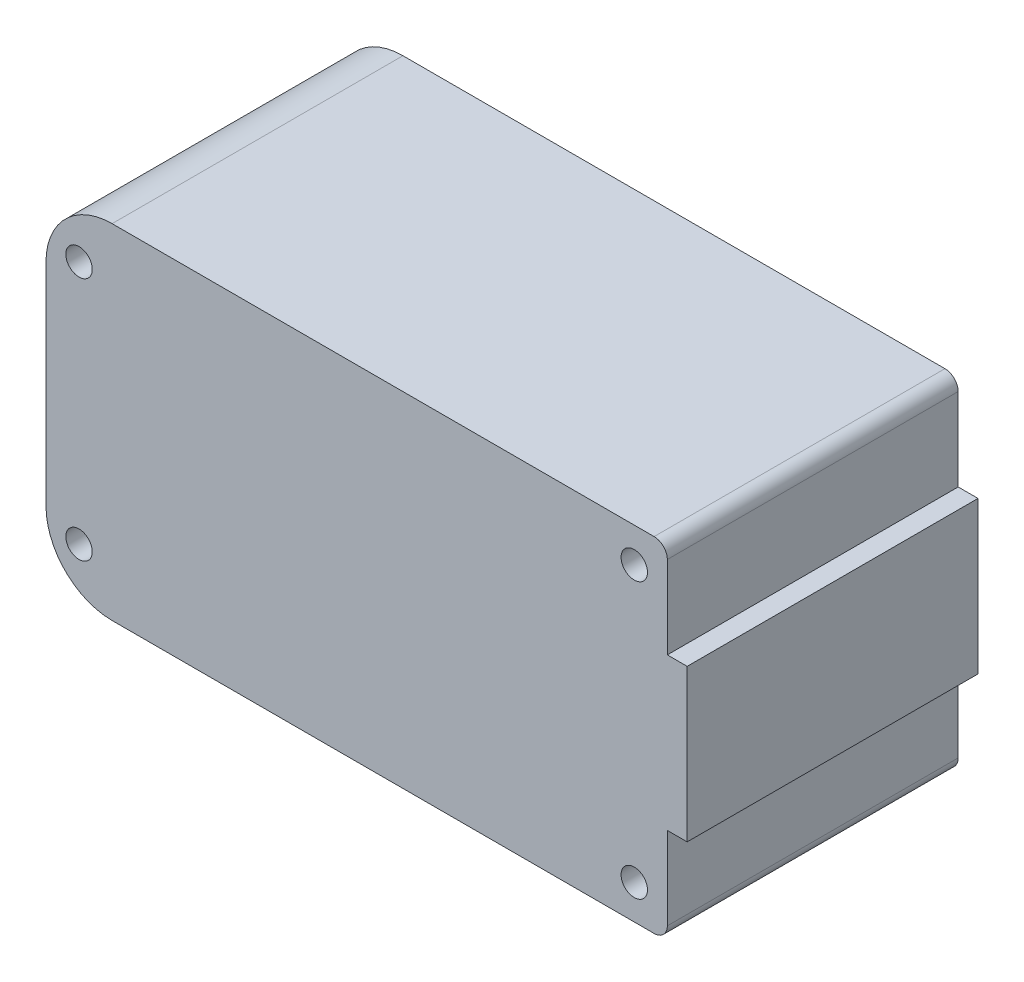
ISO-10303-21;
HEADER;
FILE_DESCRIPTION(('STEP AP214'),'2;1');
FILE_NAME('part.step','',(''),(''),'','','');
FILE_SCHEMA(('AUTOMOTIVE_DESIGN { 1 0 10303 214 1 1 1 1 }'));
ENDSEC;
DATA;
#1=APPLICATION_CONTEXT('core data for automotive mechanical design processes');
#2=APPLICATION_PROTOCOL_DEFINITION('international standard','automotive_design',2000,#1);
#3=PRODUCT_CONTEXT('',#1,'mechanical');
#4=PRODUCT('Part','Part','',(#3));
#5=PRODUCT_RELATED_PRODUCT_CATEGORY('part','',(#4));
#6=PRODUCT_DEFINITION_FORMATION('','',#4);
#7=PRODUCT_DEFINITION_CONTEXT('part definition',#1,'design');
#8=PRODUCT_DEFINITION('design','',#6,#7);
#9=PRODUCT_DEFINITION_SHAPE('','',#8);
#10=(LENGTH_UNIT() NAMED_UNIT(*) SI_UNIT(.MILLI.,.METRE.));
#11=(NAMED_UNIT(*) PLANE_ANGLE_UNIT() SI_UNIT($,.RADIAN.));
#12=(NAMED_UNIT(*) SI_UNIT($,.STERADIAN.) SOLID_ANGLE_UNIT());
#13=UNCERTAINTY_MEASURE_WITH_UNIT(LENGTH_MEASURE(1.E-05),#10,'distance_accuracy_value','');
#14=(GEOMETRIC_REPRESENTATION_CONTEXT(3) GLOBAL_UNCERTAINTY_ASSIGNED_CONTEXT((#13)) GLOBAL_UNIT_ASSIGNED_CONTEXT((#10,
#11,#12)) REPRESENTATION_CONTEXT('',''));
#15=CARTESIAN_POINT('',(0.,0.,0.));
#16=DIRECTION('',(0.,0.,1.));
#17=DIRECTION('',(1.,0.,0.));
#18=AXIS2_PLACEMENT_3D('',#15,#16,#17);
#19=CARTESIAN_POINT('',(34.5,-12.,11.));
#20=DIRECTION('',(0.,0.,-1.));
#21=DIRECTION('',(-1.,0.,0.));
#22=AXIS2_PLACEMENT_3D('',#19,#20,#21);
#23=CYLINDRICAL_SURFACE('',#22,1.);
#24=DIRECTION('',(0.,0.,-1.));
#25=VECTOR('',#24,1.);
#26=CARTESIAN_POINT('',(34.5,-13.,0.));
#27=LINE('',#26,#25);
#28=CARTESIAN_POINT('',(34.5,-13.,11.));
#29=VERTEX_POINT('',#28);
#30=CARTESIAN_POINT('',(34.5,-13.,-11.));
#31=VERTEX_POINT('',#30);
#32=EDGE_CURVE('E139',#29,#31,#27,.T.);
#33=ORIENTED_EDGE('',*,*,#32,.T.);
#34=CARTESIAN_POINT('',(34.5,-12.,-11.));
#35=DIRECTION('',(0.,0.,-1.));
#36=DIRECTION('',(-1.,0.,0.));
#37=AXIS2_PLACEMENT_3D('',#34,#35,#36);
#38=CIRCLE('',#37,1.);
#39=CARTESIAN_POINT('',(35.50000000125,-12.,-11.));
#40=VERTEX_POINT('',#39);
#41=EDGE_CURVE('E20',#40,#31,#38,.T.);
#42=ORIENTED_EDGE('',*,*,#41,.F.);
#43=DIRECTION('',(0.,0.,1.));
#44=VECTOR('',#43,1.);
#45=CARTESIAN_POINT('',(35.5,-12.,0.));
#46=LINE('',#45,#44);
#47=CARTESIAN_POINT('',(35.50000000125,-12.,11.));
#48=VERTEX_POINT('',#47);
#49=EDGE_CURVE('E138',#40,#48,#46,.T.);
#50=ORIENTED_EDGE('',*,*,#49,.T.);
#51=CARTESIAN_POINT('',(34.5,-12.,11.));
#52=DIRECTION('',(0.,0.,-1.));
#53=DIRECTION('',(-1.,0.,0.));
#54=AXIS2_PLACEMENT_3D('',#51,#52,#53);
#55=CIRCLE('',#54,1.);
#56=EDGE_CURVE('E131',#29,#48,#55,.F.);
#57=ORIENTED_EDGE('',*,*,#56,.F.);
#58=EDGE_LOOP('',(#33,#42,#50,#57));
#59=FACE_BOUND('',#58,.T.);
#60=ADVANCED_FACE('F16',(#59),#23,.T.);
#61=CARTESIAN_POINT('',(35.5,-5.75,-11.));
#62=DIRECTION('',(0.,1.,0.));
#63=DIRECTION('',(0.,0.,1.));
#64=AXIS2_PLACEMENT_3D('',#61,#62,#63);
#65=PLANE('',#64);
#66=DIRECTION('',(0.,0.,1.));
#67=VECTOR('',#66,1.);
#68=CARTESIAN_POINT('',(37.,-5.75,0.));
#69=LINE('',#68,#67);
#70=CARTESIAN_POINT('',(37.,-5.7499999995,-11.));
#71=VERTEX_POINT('',#70);
#72=CARTESIAN_POINT('',(37.,-5.74999999966667,11.));
#73=VERTEX_POINT('',#72);
#74=EDGE_CURVE('E127',#71,#73,#69,.T.);
#75=ORIENTED_EDGE('',*,*,#74,.T.);
#76=DIRECTION('',(1.,0.,0.));
#77=VECTOR('',#76,1.);
#78=CARTESIAN_POINT('',(36.25,-5.75,11.));
#79=LINE('',#78,#77);
#80=CARTESIAN_POINT('',(35.5000000008333,-5.74999999866667,11.));
#81=VERTEX_POINT('',#80);
#82=EDGE_CURVE('E121',#81,#73,#79,.T.);
#83=ORIENTED_EDGE('',*,*,#82,.F.);
#84=DIRECTION('',(0.,0.,-1.));
#85=VECTOR('',#84,1.);
#86=CARTESIAN_POINT('',(35.5,-5.75,0.));
#87=LINE('',#86,#85);
#88=CARTESIAN_POINT('',(35.5000000008333,-5.74999999866667,-11.));
#89=VERTEX_POINT('',#88);
#90=EDGE_CURVE('E124',#81,#89,#87,.T.);
#91=ORIENTED_EDGE('',*,*,#90,.T.);
#92=DIRECTION('',(-1.,0.,0.));
#93=VECTOR('',#92,1.);
#94=CARTESIAN_POINT('',(36.25,-5.75,-11.));
#95=LINE('',#94,#93);
#96=EDGE_CURVE('E130',#71,#89,#95,.T.);
#97=ORIENTED_EDGE('',*,*,#96,.F.);
#98=EDGE_LOOP('',(#75,#83,#91,#97));
#99=FACE_BOUND('',#98,.T.);
#100=ADVANCED_FACE('F123',(#99),#65,.F.);
#101=CARTESIAN_POINT('',(35.5,5.75,11.));
#102=DIRECTION('',(0.,-1.,0.));
#103=DIRECTION('',(0.,0.,-1.));
#104=AXIS2_PLACEMENT_3D('',#101,#102,#103);
#105=PLANE('',#104);
#106=DIRECTION('',(0.,0.,1.));
#107=VECTOR('',#106,1.);
#108=CARTESIAN_POINT('',(35.5,5.75,0.));
#109=LINE('',#108,#107);
#110=CARTESIAN_POINT('',(35.5000000008333,5.74999999866667,-11.));
#111=VERTEX_POINT('',#110);
#112=CARTESIAN_POINT('',(35.5000000008333,5.74999999866667,11.));
#113=VERTEX_POINT('',#112);
#114=EDGE_CURVE('E173',#111,#113,#109,.T.);
#115=ORIENTED_EDGE('',*,*,#114,.T.);
#116=DIRECTION('',(-1.,0.,0.));
#117=VECTOR('',#116,1.);
#118=CARTESIAN_POINT('',(36.25,5.75,11.));
#119=LINE('',#118,#117);
#120=CARTESIAN_POINT('',(37.,5.75,11.));
#121=VERTEX_POINT('',#120);
#122=EDGE_CURVE('E106',#121,#113,#119,.T.);
#123=ORIENTED_EDGE('',*,*,#122,.F.);
#124=DIRECTION('',(0.,0.,-1.));
#125=VECTOR('',#124,1.);
#126=CARTESIAN_POINT('',(37.,5.75,0.));
#127=LINE('',#126,#125);
#128=CARTESIAN_POINT('',(37.,5.75,-11.));
#129=VERTEX_POINT('',#128);
#130=EDGE_CURVE('E175',#121,#129,#127,.T.);
#131=ORIENTED_EDGE('',*,*,#130,.T.);
#132=DIRECTION('',(1.,0.,0.));
#133=VECTOR('',#132,1.);
#134=CARTESIAN_POINT('',(36.25,5.75,-11.));
#135=LINE('',#134,#133);
#136=EDGE_CURVE('E189',#111,#129,#135,.T.);
#137=ORIENTED_EDGE('',*,*,#136,.F.);
#138=EDGE_LOOP('',(#115,#123,#131,#137));
#139=FACE_BOUND('',#138,.T.);
#140=ADVANCED_FACE('F316',(#139),#105,.F.);
#141=CARTESIAN_POINT('',(34.5,12.,11.));
#142=DIRECTION('',(0.,0.,-1.));
#143=DIRECTION('',(-1.,0.,0.));
#144=AXIS2_PLACEMENT_3D('',#141,#142,#143);
#145=CYLINDRICAL_SURFACE('',#144,1.);
#146=DIRECTION('',(0.,0.,-1.));
#147=VECTOR('',#146,1.);
#148=CARTESIAN_POINT('',(35.5,12.,0.));
#149=LINE('',#148,#147);
#150=CARTESIAN_POINT('',(35.50000000125,12.,11.));
#151=VERTEX_POINT('',#150);
#152=CARTESIAN_POINT('',(35.50000000125,12.,-11.));
#153=VERTEX_POINT('',#152);
#154=EDGE_CURVE('E171',#151,#153,#149,.T.);
#155=ORIENTED_EDGE('',*,*,#154,.T.);
#156=CARTESIAN_POINT('',(34.5,12.,-11.));
#157=DIRECTION('',(0.,0.,-1.));
#158=DIRECTION('',(-1.,0.,0.));
#159=AXIS2_PLACEMENT_3D('',#156,#157,#158);
#160=CIRCLE('',#159,1.);
#161=CARTESIAN_POINT('',(34.5,13.,-11.));
#162=VERTEX_POINT('',#161);
#163=EDGE_CURVE('E35',#162,#153,#160,.T.);
#164=ORIENTED_EDGE('',*,*,#163,.F.);
#165=DIRECTION('',(0.,0.,1.));
#166=VECTOR('',#165,1.);
#167=CARTESIAN_POINT('',(34.5,13.,0.));
#168=LINE('',#167,#166);
#169=CARTESIAN_POINT('',(34.5,13.,11.));
#170=VERTEX_POINT('',#169);
#171=EDGE_CURVE('E164',#162,#170,#168,.T.);
#172=ORIENTED_EDGE('',*,*,#171,.T.);
#173=CARTESIAN_POINT('',(34.5,12.,11.));
#174=DIRECTION('',(0.,0.,-1.));
#175=DIRECTION('',(-1.,0.,0.));
#176=AXIS2_PLACEMENT_3D('',#173,#174,#175);
#177=CIRCLE('',#176,1.);
#178=EDGE_CURVE('E98',#151,#170,#177,.F.);
#179=ORIENTED_EDGE('',*,*,#178,.F.);
#180=EDGE_LOOP('',(#155,#164,#172,#179));
#181=FACE_BOUND('',#180,.T.);
#182=ADVANCED_FACE('F251',(#181),#145,.T.);
#183=CARTESIAN_POINT('',(-6.5,8.,11.));
#184=DIRECTION('',(0.,0.,-1.));
#185=DIRECTION('',(-1.,0.,0.));
#186=AXIS2_PLACEMENT_3D('',#183,#184,#185);
#187=CYLINDRICAL_SURFACE('',#186,5.);
#188=DIRECTION('',(0.,0.,-1.));
#189=VECTOR('',#188,1.);
#190=CARTESIAN_POINT('',(-6.5,13.,0.));
#191=LINE('',#190,#189);
#192=CARTESIAN_POINT('',(-6.5,13.,11.));
#193=VERTEX_POINT('',#192);
#194=CARTESIAN_POINT('',(-6.5,13.,-11.));
#195=VERTEX_POINT('',#194);
#196=EDGE_CURVE('E168',#193,#195,#191,.T.);
#197=ORIENTED_EDGE('',*,*,#196,.T.);
#198=CARTESIAN_POINT('',(-6.5,8.,-11.));
#199=DIRECTION('',(0.,0.,-1.));
#200=DIRECTION('',(-1.,0.,0.));
#201=AXIS2_PLACEMENT_3D('',#198,#199,#200);
#202=CIRCLE('',#201,5.);
#203=CARTESIAN_POINT('',(-11.5,8.,-11.));
#204=VERTEX_POINT('',#203);
#205=EDGE_CURVE('E233',#195,#204,#202,.F.);
#206=ORIENTED_EDGE('',*,*,#205,.T.);
#207=DIRECTION('',(0.,0.,1.));
#208=VECTOR('',#207,1.);
#209=CARTESIAN_POINT('',(-11.5,8.,0.));
#210=LINE('',#209,#208);
#211=CARTESIAN_POINT('',(-11.5,8.,11.));
#212=VERTEX_POINT('',#211);
#213=EDGE_CURVE('E186',#204,#212,#210,.T.);
#214=ORIENTED_EDGE('',*,*,#213,.T.);
#215=CARTESIAN_POINT('',(-6.5,8.,11.));
#216=DIRECTION('',(0.,0.,-1.));
#217=DIRECTION('',(-1.,0.,0.));
#218=AXIS2_PLACEMENT_3D('',#215,#216,#217);
#219=CIRCLE('',#218,5.);
#220=EDGE_CURVE('E158',#193,#212,#219,.F.);
#221=ORIENTED_EDGE('',*,*,#220,.F.);
#222=EDGE_LOOP('',(#197,#206,#214,#221));
#223=FACE_BOUND('',#222,.T.);
#224=ADVANCED_FACE('F275',(#223),#187,.T.);
#225=CARTESIAN_POINT('',(-11.5,-8.,-11.));
#226=DIRECTION('',(1.,0.,0.));
#227=DIRECTION('',(0.,1.,0.));
#228=AXIS2_PLACEMENT_3D('',#225,#226,#227);
#229=PLANE('',#228);
#230=ORIENTED_EDGE('',*,*,#213,.F.);
#231=DIRECTION('',(0.,-1.,0.));
#232=VECTOR('',#231,1.);
#233=CARTESIAN_POINT('',(-11.5,0.,-11.));
#234=LINE('',#233,#232);
#235=CARTESIAN_POINT('',(-11.5,-8.00000000044897,-11.));
#236=VERTEX_POINT('',#235);
#237=EDGE_CURVE('E152',#204,#236,#234,.T.);
#238=ORIENTED_EDGE('',*,*,#237,.T.);
#239=DIRECTION('',(0.,0.,-1.));
#240=VECTOR('',#239,1.);
#241=CARTESIAN_POINT('',(-11.5,-8.00000000089794,0.));
#242=LINE('',#241,#240);
#243=CARTESIAN_POINT('',(-11.5,-8.00000000044897,11.));
#244=VERTEX_POINT('',#243);
#245=EDGE_CURVE('E182',#236,#244,#242,.F.);
#246=ORIENTED_EDGE('',*,*,#245,.T.);
#247=DIRECTION('',(0.,-1.,0.));
#248=VECTOR('',#247,1.);
#249=CARTESIAN_POINT('',(-11.5,0.,11.));
#250=LINE('',#249,#248);
#251=EDGE_CURVE('E156',#212,#244,#250,.T.);
#252=ORIENTED_EDGE('',*,*,#251,.F.);
#253=EDGE_LOOP('',(#230,#238,#246,#252));
#254=FACE_BOUND('',#253,.T.);
#255=ADVANCED_FACE('F273',(#254),#229,.F.);
#256=CARTESIAN_POINT('',(-6.5,-8.,11.));
#257=DIRECTION('',(0.,0.,-1.));
#258=DIRECTION('',(-1.,0.,0.));
#259=AXIS2_PLACEMENT_3D('',#256,#257,#258);
#260=CYLINDRICAL_SURFACE('',#259,5.);
#261=ORIENTED_EDGE('',*,*,#245,.F.);
#262=CARTESIAN_POINT('',(-6.5,-8.,-11.));
#263=DIRECTION('',(0.,0.,-1.));
#264=DIRECTION('',(-1.,0.,0.));
#265=AXIS2_PLACEMENT_3D('',#262,#263,#264);
#266=CIRCLE('',#265,5.);
#267=CARTESIAN_POINT('',(-6.5,-13.,-11.));
#268=VERTEX_POINT('',#267);
#269=EDGE_CURVE('E229',#236,#268,#266,.F.);
#270=ORIENTED_EDGE('',*,*,#269,.T.);
#271=DIRECTION('',(0.,0.,1.));
#272=VECTOR('',#271,1.);
#273=CARTESIAN_POINT('',(-6.5,-13.,0.));
#274=LINE('',#273,#272);
#275=CARTESIAN_POINT('',(-6.5,-13.,11.));
#276=VERTEX_POINT('',#275);
#277=EDGE_CURVE('E72',#268,#276,#274,.T.);
#278=ORIENTED_EDGE('',*,*,#277,.T.);
#279=CARTESIAN_POINT('',(-6.5,-8.,11.));
#280=DIRECTION('',(0.,0.,-1.));
#281=DIRECTION('',(-1.,0.,0.));
#282=AXIS2_PLACEMENT_3D('',#279,#280,#281);
#283=CIRCLE('',#282,5.);
#284=EDGE_CURVE('E148',#244,#276,#283,.F.);
#285=ORIENTED_EDGE('',*,*,#284,.F.);
#286=EDGE_LOOP('',(#261,#270,#278,#285));
#287=FACE_BOUND('',#286,.T.);
#288=ADVANCED_FACE('F269',(#287),#260,.T.);
#289=CARTESIAN_POINT('',(34.5,-13.,-11.));
#290=DIRECTION('',(0.,1.,0.));
#291=DIRECTION('',(-1.,0.,0.));
#292=AXIS2_PLACEMENT_3D('',#289,#290,#291);
#293=PLANE('',#292);
#294=ORIENTED_EDGE('',*,*,#32,.F.);
#295=DIRECTION('',(1.,0.,0.));
#296=VECTOR('',#295,1.);
#297=CARTESIAN_POINT('',(12.75,-13.,11.));
#298=LINE('',#297,#296);
#299=EDGE_CURVE('E144',#276,#29,#298,.T.);
#300=ORIENTED_EDGE('',*,*,#299,.F.);
#301=ORIENTED_EDGE('',*,*,#277,.F.);
#302=DIRECTION('',(1.,0.,0.));
#303=VECTOR('',#302,1.);
#304=CARTESIAN_POINT('',(12.75,-13.,-11.));
#305=LINE('',#304,#303);
#306=EDGE_CURVE('E232',#268,#31,#305,.T.);
#307=ORIENTED_EDGE('',*,*,#306,.T.);
#308=EDGE_LOOP('',(#294,#300,#301,#307));
#309=FACE_BOUND('',#308,.T.);
#310=ADVANCED_FACE('F264',(#309),#293,.F.);
#311=CARTESIAN_POINT('',(35.5,-12.,-11.));
#312=DIRECTION('',(-1.,0.,0.));
#313=DIRECTION('',(0.,0.,1.));
#314=AXIS2_PLACEMENT_3D('',#311,#312,#313);
#315=PLANE('',#314);
#316=ORIENTED_EDGE('',*,*,#49,.F.);
#317=DIRECTION('',(0.,1.,0.));
#318=VECTOR('',#317,1.);
#319=CARTESIAN_POINT('',(35.5000000025,0.,-11.));
#320=LINE('',#319,#318);
#321=EDGE_CURVE('E137',#40,#89,#320,.T.);
#322=ORIENTED_EDGE('',*,*,#321,.T.);
#323=ORIENTED_EDGE('',*,*,#90,.F.);
#324=DIRECTION('',(0.,1.,0.));
#325=VECTOR('',#324,1.);
#326=CARTESIAN_POINT('',(35.5000000025,0.,11.));
#327=LINE('',#326,#325);
#328=EDGE_CURVE('E136',#48,#81,#327,.T.);
#329=ORIENTED_EDGE('',*,*,#328,.F.);
#330=EDGE_LOOP('',(#316,#322,#323,#329));
#331=FACE_BOUND('',#330,.T.);
#332=ADVANCED_FACE('F135',(#331),#315,.F.);
#333=CARTESIAN_POINT('',(37.,-5.75,-11.));
#334=DIRECTION('',(-1.,0.,0.));
#335=DIRECTION('',(0.,0.,1.));
#336=AXIS2_PLACEMENT_3D('',#333,#334,#335);
#337=PLANE('',#336);
#338=ORIENTED_EDGE('',*,*,#130,.F.);
#339=DIRECTION('',(0.,1.,0.));
#340=VECTOR('',#339,1.);
#341=CARTESIAN_POINT('',(37.,0.,11.));
#342=LINE('',#341,#340);
#343=EDGE_CURVE('E143',#73,#121,#342,.T.);
#344=ORIENTED_EDGE('',*,*,#343,.F.);
#345=ORIENTED_EDGE('',*,*,#74,.F.);
#346=DIRECTION('',(0.,1.,0.));
#347=VECTOR('',#346,1.);
#348=CARTESIAN_POINT('',(37.,0.,-11.));
#349=LINE('',#348,#347);
#350=EDGE_CURVE('E206',#71,#129,#349,.T.);
#351=ORIENTED_EDGE('',*,*,#350,.T.);
#352=EDGE_LOOP('',(#338,#344,#345,#351));
#353=FACE_BOUND('',#352,.T.);
#354=ADVANCED_FACE('F291',(#353),#337,.F.);
#355=CARTESIAN_POINT('',(35.5,5.75,-11.));
#356=DIRECTION('',(-1.,0.,0.));
#357=DIRECTION('',(0.,0.,1.));
#358=AXIS2_PLACEMENT_3D('',#355,#356,#357);
#359=PLANE('',#358);
#360=ORIENTED_EDGE('',*,*,#154,.F.);
#361=DIRECTION('',(0.,1.,0.));
#362=VECTOR('',#361,1.);
#363=CARTESIAN_POINT('',(35.5000000025,0.,11.));
#364=LINE('',#363,#362);
#365=EDGE_CURVE('E162',#113,#151,#364,.T.);
#366=ORIENTED_EDGE('',*,*,#365,.F.);
#367=ORIENTED_EDGE('',*,*,#114,.F.);
#368=DIRECTION('',(0.,1.,0.));
#369=VECTOR('',#368,1.);
#370=CARTESIAN_POINT('',(35.5000000025,0.,-11.));
#371=LINE('',#370,#369);
#372=EDGE_CURVE('E209',#111,#153,#371,.T.);
#373=ORIENTED_EDGE('',*,*,#372,.T.);
#374=EDGE_LOOP('',(#360,#366,#367,#373));
#375=FACE_BOUND('',#374,.T.);
#376=ADVANCED_FACE('F255',(#375),#359,.F.);
#377=CARTESIAN_POINT('',(-6.5,13.,-11.));
#378=DIRECTION('',(0.,-1.,0.));
#379=DIRECTION('',(1.,0.,0.));
#380=AXIS2_PLACEMENT_3D('',#377,#378,#379);
#381=PLANE('',#380);
#382=ORIENTED_EDGE('',*,*,#171,.F.);
#383=DIRECTION('',(-1.,0.,0.));
#384=VECTOR('',#383,1.);
#385=CARTESIAN_POINT('',(12.75,13.,-11.));
#386=LINE('',#385,#384);
#387=EDGE_CURVE('E228',#162,#195,#386,.T.);
#388=ORIENTED_EDGE('',*,*,#387,.T.);
#389=ORIENTED_EDGE('',*,*,#196,.F.);
#390=DIRECTION('',(-1.,0.,0.));
#391=VECTOR('',#390,1.);
#392=CARTESIAN_POINT('',(12.75,13.,11.));
#393=LINE('',#392,#391);
#394=EDGE_CURVE('E159',#170,#193,#393,.T.);
#395=ORIENTED_EDGE('',*,*,#394,.F.);
#396=EDGE_LOOP('',(#382,#388,#389,#395));
#397=FACE_BOUND('',#396,.T.);
#398=ADVANCED_FACE('F279',(#397),#381,.F.);
#399=CARTESIAN_POINT('',(33.,-10.4,11.));
#400=DIRECTION('',(0.,0.,-1.));
#401=DIRECTION('',(-1.,0.,0.));
#402=AXIS2_PLACEMENT_3D('',#399,#400,#401);
#403=CYLINDRICAL_SURFACE('',#402,1.);
#404=CARTESIAN_POINT('',(33.,-10.4,-11.));
#405=DIRECTION('',(0.,0.,-1.));
#406=DIRECTION('',(-1.,0.,0.));
#407=AXIS2_PLACEMENT_3D('',#404,#405,#406);
#408=CIRCLE('',#407,1.);
#409=CARTESIAN_POINT('',(32.,-10.4,-11.));
#410=VERTEX_POINT('',#409);
#411=EDGE_CURVE('E225',#410,#410,#408,.T.);
#412=ORIENTED_EDGE('',*,*,#411,.T.);
#413=EDGE_LOOP('',(#412));
#414=FACE_BOUND('',#413,.T.);
#415=CARTESIAN_POINT('',(33.,-10.4,11.));
#416=DIRECTION('',(0.,0.,-1.));
#417=DIRECTION('',(-1.,0.,0.));
#418=AXIS2_PLACEMENT_3D('',#415,#416,#417);
#419=CIRCLE('',#418,1.);
#420=CARTESIAN_POINT('',(32.,-10.4,11.));
#421=VERTEX_POINT('',#420);
#422=EDGE_CURVE('E146',#421,#421,#419,.T.);
#423=ORIENTED_EDGE('',*,*,#422,.F.);
#424=EDGE_LOOP('',(#423));
#425=FACE_BOUND('',#424,.T.);
#426=ADVANCED_FACE('F281',(#414,#425),#403,.F.);
#427=CARTESIAN_POINT('',(-9.,9.25,11.));
#428=DIRECTION('',(0.,0.,-1.));
#429=DIRECTION('',(-1.,0.,0.));
#430=AXIS2_PLACEMENT_3D('',#427,#428,#429);
#431=CYLINDRICAL_SURFACE('',#430,0.999999999999999);
#432=CARTESIAN_POINT('',(-9.,9.25,-11.));
#433=DIRECTION('',(0.,0.,-1.));
#434=DIRECTION('',(-1.,0.,0.));
#435=AXIS2_PLACEMENT_3D('',#432,#433,#434);
#436=CIRCLE('',#435,0.999999999999999);
#437=CARTESIAN_POINT('',(-10.,9.25,-11.));
#438=VERTEX_POINT('',#437);
#439=EDGE_CURVE('E222',#438,#438,#436,.T.);
#440=ORIENTED_EDGE('',*,*,#439,.T.);
#441=EDGE_LOOP('',(#440));
#442=FACE_BOUND('',#441,.T.);
#443=CARTESIAN_POINT('',(-9.,9.25,11.));
#444=DIRECTION('',(0.,0.,-1.));
#445=DIRECTION('',(-1.,0.,0.));
#446=AXIS2_PLACEMENT_3D('',#443,#444,#445);
#447=CIRCLE('',#446,0.999999999999999);
#448=CARTESIAN_POINT('',(-10.,9.25,11.));
#449=VERTEX_POINT('',#448);
#450=EDGE_CURVE('E239',#449,#449,#447,.T.);
#451=ORIENTED_EDGE('',*,*,#450,.F.);
#452=EDGE_LOOP('',(#451));
#453=FACE_BOUND('',#452,.T.);
#454=ADVANCED_FACE('F288',(#442,#453),#431,.F.);
#455=CARTESIAN_POINT('',(33.,10.4,11.));
#456=DIRECTION('',(0.,0.,-1.));
#457=DIRECTION('',(-1.,0.,0.));
#458=AXIS2_PLACEMENT_3D('',#455,#456,#457);
#459=CYLINDRICAL_SURFACE('',#458,1.);
#460=CARTESIAN_POINT('',(33.,10.4,-11.));
#461=DIRECTION('',(0.,0.,-1.));
#462=DIRECTION('',(-1.,0.,0.));
#463=AXIS2_PLACEMENT_3D('',#460,#461,#462);
#464=CIRCLE('',#463,1.);
#465=CARTESIAN_POINT('',(32.,10.4,-11.));
#466=VERTEX_POINT('',#465);
#467=EDGE_CURVE('E219',#466,#466,#464,.T.);
#468=ORIENTED_EDGE('',*,*,#467,.T.);
#469=EDGE_LOOP('',(#468));
#470=FACE_BOUND('',#469,.T.);
#471=CARTESIAN_POINT('',(33.,10.4,11.));
#472=DIRECTION('',(0.,0.,-1.));
#473=DIRECTION('',(-1.,0.,0.));
#474=AXIS2_PLACEMENT_3D('',#471,#472,#473);
#475=CIRCLE('',#474,1.);
#476=CARTESIAN_POINT('',(32.,10.4,11.));
#477=VERTEX_POINT('',#476);
#478=EDGE_CURVE('E236',#477,#477,#475,.T.);
#479=ORIENTED_EDGE('',*,*,#478,.F.);
#480=EDGE_LOOP('',(#479));
#481=FACE_BOUND('',#480,.T.);
#482=ADVANCED_FACE('F303',(#470,#481),#459,.F.);
#483=CARTESIAN_POINT('',(-11.5,-13.,11.));
#484=DIRECTION('',(0.,0.,1.));
#485=DIRECTION('',(1.,0.,0.));
#486=AXIS2_PLACEMENT_3D('',#483,#484,#485);
#487=PLANE('',#486);
#488=CARTESIAN_POINT('',(-9.,-9.25,11.));
#489=DIRECTION('',(0.,0.,-1.));
#490=DIRECTION('',(-1.,0.,0.));
#491=AXIS2_PLACEMENT_3D('',#488,#489,#490);
#492=CIRCLE('',#491,0.999999999999999);
#493=CARTESIAN_POINT('',(-10.,-9.25,11.));
#494=VERTEX_POINT('',#493);
#495=EDGE_CURVE('E26',#494,#494,#492,.F.);
#496=ORIENTED_EDGE('',*,*,#495,.F.);
#497=EDGE_LOOP('',(#496));
#498=FACE_BOUND('',#497,.T.);
#499=ORIENTED_EDGE('',*,*,#478,.T.);
#500=EDGE_LOOP('',(#499));
#501=FACE_BOUND('',#500,.T.);
#502=ORIENTED_EDGE('',*,*,#450,.T.);
#503=EDGE_LOOP('',(#502));
#504=FACE_BOUND('',#503,.T.);
#505=ORIENTED_EDGE('',*,*,#422,.T.);
#506=EDGE_LOOP('',(#505));
#507=FACE_BOUND('',#506,.T.);
#508=ORIENTED_EDGE('',*,*,#343,.T.);
#509=ORIENTED_EDGE('',*,*,#122,.T.);
#510=ORIENTED_EDGE('',*,*,#365,.T.);
#511=ORIENTED_EDGE('',*,*,#178,.T.);
#512=ORIENTED_EDGE('',*,*,#394,.T.);
#513=ORIENTED_EDGE('',*,*,#220,.T.);
#514=ORIENTED_EDGE('',*,*,#251,.T.);
#515=ORIENTED_EDGE('',*,*,#284,.T.);
#516=ORIENTED_EDGE('',*,*,#299,.T.);
#517=ORIENTED_EDGE('',*,*,#56,.T.);
#518=ORIENTED_EDGE('',*,*,#328,.T.);
#519=ORIENTED_EDGE('',*,*,#82,.T.);
#520=EDGE_LOOP('',(#508,#509,#510,#511,#512,#513,#514,#515,#516,#517,#518,#519));
#521=FACE_BOUND('',#520,.T.);
#522=ADVANCED_FACE('F141',(#498,#501,#504,#507,#521),#487,.T.);
#523=CARTESIAN_POINT('',(-11.5,-13.,-11.));
#524=DIRECTION('',(0.,0.,1.));
#525=DIRECTION('',(1.,0.,0.));
#526=AXIS2_PLACEMENT_3D('',#523,#524,#525);
#527=PLANE('',#526);
#528=CARTESIAN_POINT('',(-9.,-9.25,-11.));
#529=DIRECTION('',(0.,0.,-1.));
#530=DIRECTION('',(-1.,0.,0.));
#531=AXIS2_PLACEMENT_3D('',#528,#529,#530);
#532=CIRCLE('',#531,0.999999999999999);
#533=CARTESIAN_POINT('',(-10.,-9.25,-11.));
#534=VERTEX_POINT('',#533);
#535=EDGE_CURVE('E11',#534,#534,#532,.T.);
#536=ORIENTED_EDGE('',*,*,#535,.F.);
#537=EDGE_LOOP('',(#536));
#538=FACE_BOUND('',#537,.T.);
#539=ORIENTED_EDGE('',*,*,#467,.F.);
#540=EDGE_LOOP('',(#539));
#541=FACE_BOUND('',#540,.T.);
#542=ORIENTED_EDGE('',*,*,#439,.F.);
#543=EDGE_LOOP('',(#542));
#544=FACE_BOUND('',#543,.T.);
#545=ORIENTED_EDGE('',*,*,#411,.F.);
#546=EDGE_LOOP('',(#545));
#547=FACE_BOUND('',#546,.T.);
#548=ORIENTED_EDGE('',*,*,#163,.T.);
#549=ORIENTED_EDGE('',*,*,#372,.F.);
#550=ORIENTED_EDGE('',*,*,#136,.T.);
#551=ORIENTED_EDGE('',*,*,#350,.F.);
#552=ORIENTED_EDGE('',*,*,#96,.T.);
#553=ORIENTED_EDGE('',*,*,#321,.F.);
#554=ORIENTED_EDGE('',*,*,#41,.T.);
#555=ORIENTED_EDGE('',*,*,#306,.F.);
#556=ORIENTED_EDGE('',*,*,#269,.F.);
#557=ORIENTED_EDGE('',*,*,#237,.F.);
#558=ORIENTED_EDGE('',*,*,#205,.F.);
#559=ORIENTED_EDGE('',*,*,#387,.F.);
#560=EDGE_LOOP('',(#548,#549,#550,#551,#552,#553,#554,#555,#556,#557,#558,#559));
#561=FACE_BOUND('',#560,.T.);
#562=ADVANCED_FACE('F18',(#538,#541,#544,#547,#561),#527,.F.);
#563=CARTESIAN_POINT('',(-9.,-9.25,11.));
#564=DIRECTION('',(0.,0.,-1.));
#565=DIRECTION('',(-1.,0.,0.));
#566=AXIS2_PLACEMENT_3D('',#563,#564,#565);
#567=CYLINDRICAL_SURFACE('',#566,0.999999999999999);
#568=ORIENTED_EDGE('',*,*,#535,.T.);
#569=EDGE_LOOP('',(#568));
#570=FACE_BOUND('',#569,.T.);
#571=ORIENTED_EDGE('',*,*,#495,.T.);
#572=EDGE_LOOP('',(#571));
#573=FACE_BOUND('',#572,.T.);
#574=ADVANCED_FACE('F293',(#570,#573),#567,.F.);
#575=CLOSED_SHELL('',(#60,#100,#140,#182,#224,#255,#288,#310,#332,#354,#376,#398,#426,#454,#482,
#522,#562,#574));
#576=MANIFOLD_SOLID_BREP('B1',#575);
#577=ADVANCED_BREP_SHAPE_REPRESENTATION('',(#18,#576),#14);
#578=SHAPE_DEFINITION_REPRESENTATION(#9,#577);
ENDSEC;
END-ISO-10303-21;
